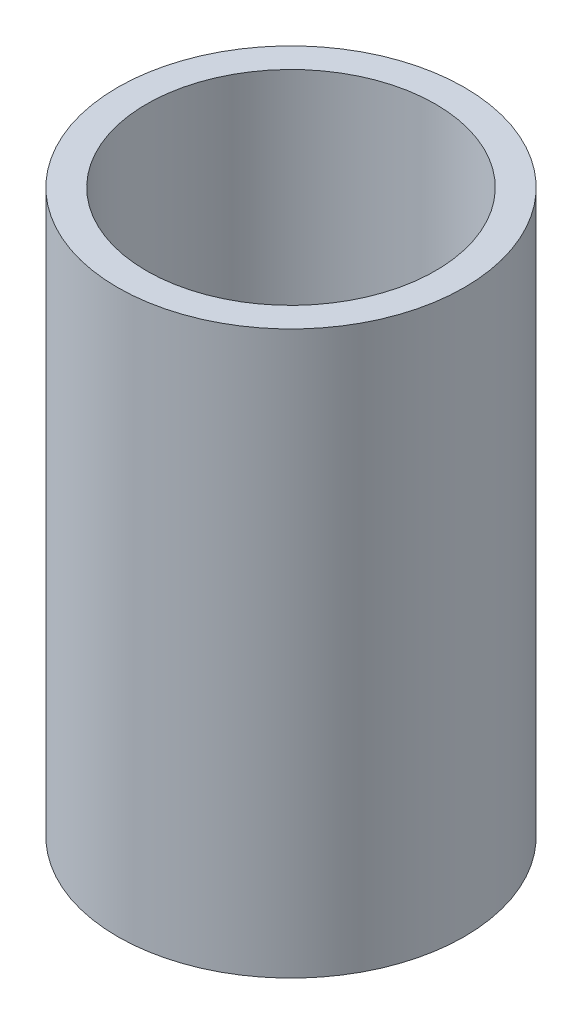
ISO-10303-21;
HEADER;
FILE_DESCRIPTION(('STEP AP214'),'2;1');
FILE_NAME('part.step','',(''),(''),'','','');
FILE_SCHEMA(('AUTOMOTIVE_DESIGN { 1 0 10303 214 1 1 1 1 }'));
ENDSEC;
DATA;
#1=APPLICATION_CONTEXT('core data for automotive mechanical design processes');
#2=APPLICATION_PROTOCOL_DEFINITION('international standard','automotive_design',2000,#1);
#3=PRODUCT_CONTEXT('',#1,'mechanical');
#4=PRODUCT('Part','Part','',(#3));
#5=PRODUCT_RELATED_PRODUCT_CATEGORY('part','',(#4));
#6=PRODUCT_DEFINITION_FORMATION('','',#4);
#7=PRODUCT_DEFINITION_CONTEXT('part definition',#1,'design');
#8=PRODUCT_DEFINITION('design','',#6,#7);
#9=PRODUCT_DEFINITION_SHAPE('','',#8);
#10=(LENGTH_UNIT() NAMED_UNIT(*) SI_UNIT(.MILLI.,.METRE.));
#11=(NAMED_UNIT(*) PLANE_ANGLE_UNIT() SI_UNIT($,.RADIAN.));
#12=(NAMED_UNIT(*) SI_UNIT($,.STERADIAN.) SOLID_ANGLE_UNIT());
#13=UNCERTAINTY_MEASURE_WITH_UNIT(LENGTH_MEASURE(1.E-05),#10,'distance_accuracy_value','');
#14=(GEOMETRIC_REPRESENTATION_CONTEXT(3) GLOBAL_UNCERTAINTY_ASSIGNED_CONTEXT((#13)) GLOBAL_UNIT_ASSIGNED_CONTEXT((#10,
#11,#12)) REPRESENTATION_CONTEXT('',''));
#15=CARTESIAN_POINT('',(0.,0.,0.));
#16=DIRECTION('',(0.,0.,1.));
#17=DIRECTION('',(1.,0.,0.));
#18=AXIS2_PLACEMENT_3D('',#15,#16,#17);
#19=CARTESIAN_POINT('',(0.,7.7216,0.));
#20=DIRECTION('',(0.,1.,0.));
#21=DIRECTION('',(0.,0.,1.));
#22=AXIS2_PLACEMENT_3D('',#19,#20,#21);
#23=PLANE('',#22);
#24=CARTESIAN_POINT('',(0.,7.7216,0.));
#25=DIRECTION('',(0.,1.,0.));
#26=DIRECTION('',(0.,0.,1.));
#27=AXIS2_PLACEMENT_3D('',#24,#25,#26);
#28=CIRCLE('',#27,2.38125);
#29=CARTESIAN_POINT('',(0.,7.7216,2.38125));
#30=VERTEX_POINT('',#29);
#31=EDGE_CURVE('E10',#30,#30,#28,.T.);
#32=ORIENTED_EDGE('',*,*,#31,.T.);
#33=EDGE_LOOP('',(#32));
#34=FACE_BOUND('',#33,.T.);
#35=CARTESIAN_POINT('',(0.,7.7216,0.));
#36=DIRECTION('',(0.,1.,0.));
#37=DIRECTION('',(0.,0.,1.));
#38=AXIS2_PLACEMENT_3D('',#35,#36,#37);
#39=CIRCLE('',#38,1.984375);
#40=CARTESIAN_POINT('',(0.,7.7216,1.984375));
#41=VERTEX_POINT('',#40);
#42=EDGE_CURVE('E369',#41,#41,#39,.T.);
#43=ORIENTED_EDGE('',*,*,#42,.F.);
#44=EDGE_LOOP('',(#43));
#45=FACE_BOUND('',#44,.T.);
#46=ADVANCED_FACE('F358',(#34,#45),#23,.T.);
#47=CARTESIAN_POINT('',(0.,0.,0.));
#48=DIRECTION('',(0.,1.,0.));
#49=DIRECTION('',(0.,0.,1.));
#50=AXIS2_PLACEMENT_3D('',#47,#48,#49);
#51=PLANE('',#50);
#52=CARTESIAN_POINT('',(0.,0.,0.));
#53=DIRECTION('',(0.,1.,0.));
#54=DIRECTION('',(0.,0.,1.));
#55=AXIS2_PLACEMENT_3D('',#52,#53,#54);
#56=CIRCLE('',#55,2.38125);
#57=CARTESIAN_POINT('',(0.,0.,2.38125));
#58=VERTEX_POINT('',#57);
#59=EDGE_CURVE('E365',#58,#58,#56,.T.);
#60=ORIENTED_EDGE('',*,*,#59,.F.);
#61=EDGE_LOOP('',(#60));
#62=FACE_BOUND('',#61,.T.);
#63=CARTESIAN_POINT('',(0.,0.,0.));
#64=DIRECTION('',(0.,1.,0.));
#65=DIRECTION('',(0.,0.,1.));
#66=AXIS2_PLACEMENT_3D('',#63,#64,#65);
#67=CIRCLE('',#66,1.984375);
#68=CARTESIAN_POINT('',(0.,0.,1.984375));
#69=VERTEX_POINT('',#68);
#70=EDGE_CURVE('E373',#69,#69,#67,.T.);
#71=ORIENTED_EDGE('',*,*,#70,.T.);
#72=EDGE_LOOP('',(#71));
#73=FACE_BOUND('',#72,.T.);
#74=ADVANCED_FACE('F379',(#62,#73),#51,.F.);
#75=CARTESIAN_POINT('',(0.,7.7216,0.));
#76=DIRECTION('',(0.,-1.,0.));
#77=DIRECTION('',(0.,0.,-1.));
#78=AXIS2_PLACEMENT_3D('',#75,#76,#77);
#79=CYLINDRICAL_SURFACE('',#78,2.38125);
#80=ORIENTED_EDGE('',*,*,#31,.F.);
#81=EDGE_LOOP('',(#80));
#82=FACE_BOUND('',#81,.T.);
#83=ORIENTED_EDGE('',*,*,#59,.T.);
#84=EDGE_LOOP('',(#83));
#85=FACE_BOUND('',#84,.T.);
#86=ADVANCED_FACE('F360',(#82,#85),#79,.T.);
#87=CARTESIAN_POINT('',(0.,7.7216,0.));
#88=DIRECTION('',(0.,-1.,0.));
#89=DIRECTION('',(0.,0.,-1.));
#90=AXIS2_PLACEMENT_3D('',#87,#88,#89);
#91=CYLINDRICAL_SURFACE('',#90,1.984375);
#92=ORIENTED_EDGE('',*,*,#42,.T.);
#93=EDGE_LOOP('',(#92));
#94=FACE_BOUND('',#93,.T.);
#95=ORIENTED_EDGE('',*,*,#70,.F.);
#96=EDGE_LOOP('',(#95));
#97=FACE_BOUND('',#96,.T.);
#98=ADVANCED_FACE('F381',(#94,#97),#91,.F.);
#99=CLOSED_SHELL('',(#46,#74,#86,#98));
#100=MANIFOLD_SOLID_BREP('B2',#99);
#101=ADVANCED_BREP_SHAPE_REPRESENTATION('',(#18,#100),#14);
#102=SHAPE_DEFINITION_REPRESENTATION(#9,#101);
ENDSEC;
END-ISO-10303-21;
